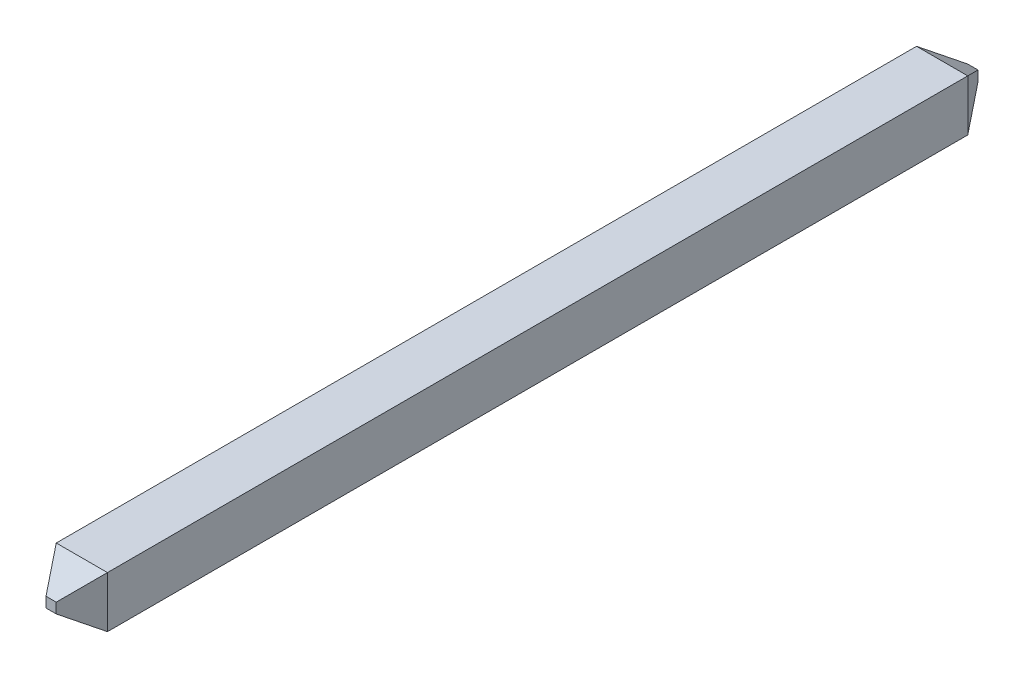
ISO-10303-21;
HEADER;
FILE_DESCRIPTION(('STEP AP214'),'2;1');
FILE_NAME('part.step','',(''),(''),'','','');
FILE_SCHEMA(('AUTOMOTIVE_DESIGN { 1 0 10303 214 1 1 1 1 }'));
ENDSEC;
DATA;
#1=APPLICATION_CONTEXT('core data for automotive mechanical design processes');
#2=APPLICATION_PROTOCOL_DEFINITION('international standard','automotive_design',2000,#1);
#3=PRODUCT_CONTEXT('',#1,'mechanical');
#4=PRODUCT('Part','Part','',(#3));
#5=PRODUCT_RELATED_PRODUCT_CATEGORY('part','',(#4));
#6=PRODUCT_DEFINITION_FORMATION('','',#4);
#7=PRODUCT_DEFINITION_CONTEXT('part definition',#1,'design');
#8=PRODUCT_DEFINITION('design','',#6,#7);
#9=PRODUCT_DEFINITION_SHAPE('','',#8);
#10=(LENGTH_UNIT() NAMED_UNIT(*) SI_UNIT(.MILLI.,.METRE.));
#11=(NAMED_UNIT(*) PLANE_ANGLE_UNIT() SI_UNIT($,.RADIAN.));
#12=(NAMED_UNIT(*) SI_UNIT($,.STERADIAN.) SOLID_ANGLE_UNIT());
#13=UNCERTAINTY_MEASURE_WITH_UNIT(LENGTH_MEASURE(1.E-05),#10,'distance_accuracy_value','');
#14=(GEOMETRIC_REPRESENTATION_CONTEXT(3) GLOBAL_UNCERTAINTY_ASSIGNED_CONTEXT((#13)) GLOBAL_UNIT_ASSIGNED_CONTEXT((#10,
#11,#12)) REPRESENTATION_CONTEXT('',''));
#15=CARTESIAN_POINT('',(0.,0.,0.));
#16=DIRECTION('',(0.,0.,1.));
#17=DIRECTION('',(1.,0.,0.));
#18=AXIS2_PLACEMENT_3D('',#15,#16,#17);
#19=CARTESIAN_POINT('',(0.0635,0.,-6.35));
#20=DIRECTION('',(-0.832050294337843,0.,0.55470019622523));
#21=DIRECTION('',(0.55470019622523,0.,0.832050294337843));
#22=AXIS2_PLACEMENT_3D('',#19,#20,#21);
#23=PLANE('',#22);
#24=DIRECTION('',(0.,1.,0.));
#25=VECTOR('',#24,1.);
#26=CARTESIAN_POINT('',(0.3175,7.9375,-5.969));
#27=LINE('',#26,#25);
#28=CARTESIAN_POINT('',(0.3175,7.3025,-5.969));
#29=VERTEX_POINT('',#28);
#30=CARTESIAN_POINT('',(0.3175,7.9375,-5.969));
#31=VERTEX_POINT('',#30);
#32=EDGE_CURVE('E103',#29,#31,#27,.T.);
#33=ORIENTED_EDGE('',*,*,#32,.F.);
#34=DIRECTION('',(-0.485071250072666,0.485071250072666,-0.727606875108999));
#35=VECTOR('',#34,1.);
#36=CARTESIAN_POINT('',(0.3175,7.3025,-5.969));
#37=LINE('',#36,#35);
#38=CARTESIAN_POINT('',(0.0635,7.5565,-6.35));
#39=VERTEX_POINT('',#38);
#40=EDGE_CURVE('E84',#29,#39,#37,.T.);
#41=ORIENTED_EDGE('',*,*,#40,.T.);
#42=DIRECTION('',(0.,1.,0.));
#43=VECTOR('',#42,1.);
#44=CARTESIAN_POINT('',(0.0635,0.,-6.35));
#45=LINE('',#44,#43);
#46=CARTESIAN_POINT('',(0.0635,7.6835,-6.35));
#47=VERTEX_POINT('',#46);
#48=EDGE_CURVE('E19',#47,#39,#45,.F.);
#49=ORIENTED_EDGE('',*,*,#48,.F.);
#50=DIRECTION('',(0.485071250072666,0.485071250072666,0.727606875108999));
#51=VECTOR('',#50,1.);
#52=CARTESIAN_POINT('',(0.0635,7.6835,-6.35));
#53=LINE('',#52,#51);
#54=EDGE_CURVE('E81',#47,#31,#53,.T.);
#55=ORIENTED_EDGE('',*,*,#54,.T.);
#56=EDGE_LOOP('',(#33,#41,#49,#55));
#57=FACE_BOUND('',#56,.T.);
#58=ADVANCED_FACE('F16',(#57),#23,.F.);
#59=CARTESIAN_POINT('',(0.3175,7.9375,4.699));
#60=DIRECTION('',(0.832050294337844,0.,0.554700196225229));
#61=DIRECTION('',(0.554700196225229,0.,-0.832050294337844));
#62=AXIS2_PLACEMENT_3D('',#59,#60,#61);
#63=PLANE('',#62);
#64=DIRECTION('',(-0.485071250072666,0.485071250072666,0.727606875108999));
#65=VECTOR('',#64,1.);
#66=CARTESIAN_POINT('',(0.3175,7.3025,4.699));
#67=LINE('',#66,#65);
#68=CARTESIAN_POINT('',(0.3175,7.3025,4.699));
#69=VERTEX_POINT('',#68);
#70=CARTESIAN_POINT('',(0.0635,7.5565,5.08));
#71=VERTEX_POINT('',#70);
#72=EDGE_CURVE('E108',#69,#71,#67,.T.);
#73=ORIENTED_EDGE('',*,*,#72,.F.);
#74=DIRECTION('',(0.,1.,0.));
#75=VECTOR('',#74,1.);
#76=CARTESIAN_POINT('',(0.3175,7.9375,4.699));
#77=LINE('',#76,#75);
#78=CARTESIAN_POINT('',(0.3175,7.9375,4.699));
#79=VERTEX_POINT('',#78);
#80=EDGE_CURVE('E105',#79,#69,#77,.F.);
#81=ORIENTED_EDGE('',*,*,#80,.F.);
#82=DIRECTION('',(0.485071250072666,0.485071250072666,-0.727606875108999));
#83=VECTOR('',#82,1.);
#84=CARTESIAN_POINT('',(0.0635,7.6835,5.08));
#85=LINE('',#84,#83);
#86=CARTESIAN_POINT('',(0.0635,7.6835,5.08));
#87=VERTEX_POINT('',#86);
#88=EDGE_CURVE('E115',#87,#79,#85,.T.);
#89=ORIENTED_EDGE('',*,*,#88,.F.);
#90=DIRECTION('',(0.,1.,0.));
#91=VECTOR('',#90,1.);
#92=CARTESIAN_POINT('',(0.0635,0.,5.08));
#93=LINE('',#92,#91);
#94=EDGE_CURVE('E111',#87,#71,#93,.F.);
#95=ORIENTED_EDGE('',*,*,#94,.T.);
#96=EDGE_LOOP('',(#73,#81,#89,#95));
#97=FACE_BOUND('',#96,.T.);
#98=ADVANCED_FACE('F181',(#97),#63,.T.);
#99=CARTESIAN_POINT('',(0.,0.,-6.35));
#100=DIRECTION('',(0.,0.,-1.));
#101=DIRECTION('',(-1.,0.,0.));
#102=AXIS2_PLACEMENT_3D('',#99,#100,#101);
#103=PLANE('',#102);
#104=DIRECTION('',(0.,1.,0.));
#105=VECTOR('',#104,1.);
#106=CARTESIAN_POINT('',(-0.0635,0.,-6.35));
#107=LINE('',#106,#105);
#108=CARTESIAN_POINT('',(-0.0635,7.5565,-6.35));
#109=VERTEX_POINT('',#108);
#110=CARTESIAN_POINT('',(-0.0634999999999999,7.6835,-6.35));
#111=VERTEX_POINT('',#110);
#112=EDGE_CURVE('E90',#109,#111,#107,.T.);
#113=ORIENTED_EDGE('',*,*,#112,.T.);
#114=DIRECTION('',(1.,0.,0.));
#115=VECTOR('',#114,1.);
#116=CARTESIAN_POINT('',(0.,7.6835,-6.35));
#117=LINE('',#116,#115);
#118=EDGE_CURVE('E86',#111,#47,#117,.T.);
#119=ORIENTED_EDGE('',*,*,#118,.T.);
#120=ORIENTED_EDGE('',*,*,#48,.T.);
#121=DIRECTION('',(1.,0.,0.));
#122=VECTOR('',#121,1.);
#123=CARTESIAN_POINT('',(0.,7.5565,-6.35));
#124=LINE('',#123,#122);
#125=EDGE_CURVE('E98',#39,#109,#124,.F.);
#126=ORIENTED_EDGE('',*,*,#125,.T.);
#127=EDGE_LOOP('',(#113,#119,#120,#126));
#128=FACE_BOUND('',#127,.T.);
#129=ADVANCED_FACE('F88',(#128),#103,.T.);
#130=CARTESIAN_POINT('',(0.,7.6835,-6.35));
#131=DIRECTION('',(0.,-0.832050294337843,0.55470019622523));
#132=DIRECTION('',(0.,-0.55470019622523,-0.832050294337843));
#133=AXIS2_PLACEMENT_3D('',#130,#131,#132);
#134=PLANE('',#133);
#135=DIRECTION('',(1.,0.,0.));
#136=VECTOR('',#135,1.);
#137=CARTESIAN_POINT('',(-0.3175,7.9375,-5.969));
#138=LINE('',#137,#136);
#139=CARTESIAN_POINT('',(-0.3175,7.9375,-5.969));
#140=VERTEX_POINT('',#139);
#141=EDGE_CURVE('E96',#31,#140,#138,.F.);
#142=ORIENTED_EDGE('',*,*,#141,.F.);
#143=ORIENTED_EDGE('',*,*,#54,.F.);
#144=ORIENTED_EDGE('',*,*,#118,.F.);
#145=DIRECTION('',(-0.485071250072667,0.485071250072666,0.727606875108998));
#146=VECTOR('',#145,1.);
#147=CARTESIAN_POINT('',(-0.0635,7.6835,-6.35));
#148=LINE('',#147,#146);
#149=EDGE_CURVE('E131',#111,#140,#148,.T.);
#150=ORIENTED_EDGE('',*,*,#149,.T.);
#151=EDGE_LOOP('',(#142,#143,#144,#150));
#152=FACE_BOUND('',#151,.T.);
#153=ADVANCED_FACE('F94',(#152),#134,.F.);
#154=CARTESIAN_POINT('',(0.,7.5565,-6.35));
#155=DIRECTION('',(0.,0.832050294337843,0.55470019622523));
#156=DIRECTION('',(0.,-0.55470019622523,0.832050294337843));
#157=AXIS2_PLACEMENT_3D('',#154,#155,#156);
#158=PLANE('',#157);
#159=DIRECTION('',(1.,0.,0.));
#160=VECTOR('',#159,1.);
#161=CARTESIAN_POINT('',(0.3175,7.3025,-5.969));
#162=LINE('',#161,#160);
#163=CARTESIAN_POINT('',(-0.3175,7.3025,-5.969));
#164=VERTEX_POINT('',#163);
#165=EDGE_CURVE('E133',#164,#29,#162,.T.);
#166=ORIENTED_EDGE('',*,*,#165,.F.);
#167=DIRECTION('',(0.485071250072667,0.485071250072666,-0.727606875108998));
#168=VECTOR('',#167,1.);
#169=CARTESIAN_POINT('',(-0.3175,7.3025,-5.969));
#170=LINE('',#169,#168);
#171=EDGE_CURVE('E127',#164,#109,#170,.T.);
#172=ORIENTED_EDGE('',*,*,#171,.T.);
#173=ORIENTED_EDGE('',*,*,#125,.F.);
#174=ORIENTED_EDGE('',*,*,#40,.F.);
#175=EDGE_LOOP('',(#166,#172,#173,#174));
#176=FACE_BOUND('',#175,.T.);
#177=ADVANCED_FACE('F177',(#176),#158,.F.);
#178=CARTESIAN_POINT('',(0.3175,7.9375,5.08));
#179=DIRECTION('',(1.,0.,0.));
#180=DIRECTION('',(0.,0.,-1.));
#181=AXIS2_PLACEMENT_3D('',#178,#179,#180);
#182=PLANE('',#181);
#183=DIRECTION('',(0.,0.,1.));
#184=VECTOR('',#183,1.);
#185=CARTESIAN_POINT('',(0.3175,7.9375,5.08));
#186=LINE('',#185,#184);
#187=EDGE_CURVE('E121',#79,#31,#186,.F.);
#188=ORIENTED_EDGE('',*,*,#187,.F.);
#189=ORIENTED_EDGE('',*,*,#80,.T.);
#190=DIRECTION('',(0.,0.,-1.));
#191=VECTOR('',#190,1.);
#192=CARTESIAN_POINT('',(0.3175,7.3025,5.08));
#193=LINE('',#192,#191);
#194=EDGE_CURVE('E136',#29,#69,#193,.F.);
#195=ORIENTED_EDGE('',*,*,#194,.F.);
#196=ORIENTED_EDGE('',*,*,#32,.T.);
#197=EDGE_LOOP('',(#188,#189,#195,#196));
#198=FACE_BOUND('',#197,.T.);
#199=ADVANCED_FACE('F179',(#198),#182,.T.);
#200=CARTESIAN_POINT('',(0.3175,7.3025,4.699));
#201=DIRECTION('',(0.,-0.832050294337844,0.554700196225229));
#202=DIRECTION('',(0.,-0.554700196225229,-0.832050294337844));
#203=AXIS2_PLACEMENT_3D('',#200,#201,#202);
#204=PLANE('',#203);
#205=DIRECTION('',(0.485071250072666,0.485071250072666,0.727606875108999));
#206=VECTOR('',#205,1.);
#207=CARTESIAN_POINT('',(-0.3175,7.3025,4.699));
#208=LINE('',#207,#206);
#209=CARTESIAN_POINT('',(-0.3175,7.3025,4.699));
#210=VERTEX_POINT('',#209);
#211=CARTESIAN_POINT('',(-0.0635,7.5565,5.08));
#212=VERTEX_POINT('',#211);
#213=EDGE_CURVE('E34',#210,#212,#208,.T.);
#214=ORIENTED_EDGE('',*,*,#213,.F.);
#215=DIRECTION('',(1.,0.,0.));
#216=VECTOR('',#215,1.);
#217=CARTESIAN_POINT('',(0.3175,7.3025,4.699));
#218=LINE('',#217,#216);
#219=EDGE_CURVE('E139',#69,#210,#218,.F.);
#220=ORIENTED_EDGE('',*,*,#219,.F.);
#221=ORIENTED_EDGE('',*,*,#72,.T.);
#222=DIRECTION('',(-1.,0.,0.));
#223=VECTOR('',#222,1.);
#224=CARTESIAN_POINT('',(0.,7.5565,5.08));
#225=LINE('',#224,#223);
#226=EDGE_CURVE('E113',#71,#212,#225,.T.);
#227=ORIENTED_EDGE('',*,*,#226,.T.);
#228=EDGE_LOOP('',(#214,#220,#221,#227));
#229=FACE_BOUND('',#228,.T.);
#230=ADVANCED_FACE('F184',(#229),#204,.T.);
#231=CARTESIAN_POINT('',(0.,0.,5.08));
#232=DIRECTION('',(0.,0.,-1.));
#233=DIRECTION('',(-1.,0.,0.));
#234=AXIS2_PLACEMENT_3D('',#231,#232,#233);
#235=PLANE('',#234);
#236=DIRECTION('',(0.,1.,0.));
#237=VECTOR('',#236,1.);
#238=CARTESIAN_POINT('',(-0.0635,7.3025,5.08));
#239=LINE('',#238,#237);
#240=CARTESIAN_POINT('',(-0.0635,7.6835,5.08));
#241=VERTEX_POINT('',#240);
#242=EDGE_CURVE('E142',#212,#241,#239,.T.);
#243=ORIENTED_EDGE('',*,*,#242,.F.);
#244=ORIENTED_EDGE('',*,*,#226,.F.);
#245=ORIENTED_EDGE('',*,*,#94,.F.);
#246=DIRECTION('',(1.,0.,0.));
#247=VECTOR('',#246,1.);
#248=CARTESIAN_POINT('',(-0.3175,7.6835,5.08));
#249=LINE('',#248,#247);
#250=EDGE_CURVE('E118',#241,#87,#249,.T.);
#251=ORIENTED_EDGE('',*,*,#250,.F.);
#252=EDGE_LOOP('',(#243,#244,#245,#251));
#253=FACE_BOUND('',#252,.T.);
#254=ADVANCED_FACE('F186',(#253),#235,.F.);
#255=CARTESIAN_POINT('',(-0.3175,7.9375,4.699));
#256=DIRECTION('',(0.,0.832050294337844,0.554700196225229));
#257=DIRECTION('',(0.,-0.554700196225229,0.832050294337844));
#258=AXIS2_PLACEMENT_3D('',#255,#256,#257);
#259=PLANE('',#258);
#260=DIRECTION('',(-0.485071250072666,0.485071250072666,-0.727606875108999));
#261=VECTOR('',#260,1.);
#262=CARTESIAN_POINT('',(-0.0635,7.6835,5.08));
#263=LINE('',#262,#261);
#264=CARTESIAN_POINT('',(-0.3175,7.9375,4.699));
#265=VERTEX_POINT('',#264);
#266=EDGE_CURVE('E145',#241,#265,#263,.T.);
#267=ORIENTED_EDGE('',*,*,#266,.F.);
#268=ORIENTED_EDGE('',*,*,#250,.T.);
#269=ORIENTED_EDGE('',*,*,#88,.T.);
#270=DIRECTION('',(1.,0.,0.));
#271=VECTOR('',#270,1.);
#272=CARTESIAN_POINT('',(-0.3175,7.9375,4.699));
#273=LINE('',#272,#271);
#274=EDGE_CURVE('E124',#265,#79,#273,.T.);
#275=ORIENTED_EDGE('',*,*,#274,.F.);
#276=EDGE_LOOP('',(#267,#268,#269,#275));
#277=FACE_BOUND('',#276,.T.);
#278=ADVANCED_FACE('F168',(#277),#259,.T.);
#279=CARTESIAN_POINT('',(-0.3175,7.9375,5.08));
#280=DIRECTION('',(0.,1.,0.));
#281=DIRECTION('',(0.,0.,1.));
#282=AXIS2_PLACEMENT_3D('',#279,#280,#281);
#283=PLANE('',#282);
#284=DIRECTION('',(0.,0.,1.));
#285=VECTOR('',#284,1.);
#286=CARTESIAN_POINT('',(-0.3175,7.9375,5.08));
#287=LINE('',#286,#285);
#288=EDGE_CURVE('E148',#265,#140,#287,.F.);
#289=ORIENTED_EDGE('',*,*,#288,.F.);
#290=ORIENTED_EDGE('',*,*,#274,.T.);
#291=ORIENTED_EDGE('',*,*,#187,.T.);
#292=ORIENTED_EDGE('',*,*,#141,.T.);
#293=EDGE_LOOP('',(#289,#290,#291,#292));
#294=FACE_BOUND('',#293,.T.);
#295=ADVANCED_FACE('F171',(#294),#283,.T.);
#296=CARTESIAN_POINT('',(-0.0635,0.,-6.35));
#297=DIRECTION('',(0.832050294337843,0.,0.55470019622523));
#298=DIRECTION('',(0.55470019622523,0.,-0.832050294337843));
#299=AXIS2_PLACEMENT_3D('',#296,#297,#298);
#300=PLANE('',#299);
#301=ORIENTED_EDGE('',*,*,#112,.F.);
#302=ORIENTED_EDGE('',*,*,#171,.F.);
#303=DIRECTION('',(0.,1.,0.));
#304=VECTOR('',#303,1.);
#305=CARTESIAN_POINT('',(-0.3175,7.3025,-5.969));
#306=LINE('',#305,#304);
#307=EDGE_CURVE('E151',#140,#164,#306,.F.);
#308=ORIENTED_EDGE('',*,*,#307,.F.);
#309=ORIENTED_EDGE('',*,*,#149,.F.);
#310=EDGE_LOOP('',(#301,#302,#308,#309));
#311=FACE_BOUND('',#310,.T.);
#312=ADVANCED_FACE('F175',(#311),#300,.F.);
#313=CARTESIAN_POINT('',(0.3175,7.3025,5.08));
#314=DIRECTION('',(0.,-1.,0.));
#315=DIRECTION('',(0.,0.,-1.));
#316=AXIS2_PLACEMENT_3D('',#313,#314,#315);
#317=PLANE('',#316);
#318=ORIENTED_EDGE('',*,*,#194,.T.);
#319=ORIENTED_EDGE('',*,*,#219,.T.);
#320=DIRECTION('',(0.,0.,1.));
#321=VECTOR('',#320,1.);
#322=CARTESIAN_POINT('',(-0.3175,7.3025,5.08));
#323=LINE('',#322,#321);
#324=EDGE_CURVE('E25',#164,#210,#323,.T.);
#325=ORIENTED_EDGE('',*,*,#324,.F.);
#326=ORIENTED_EDGE('',*,*,#165,.T.);
#327=EDGE_LOOP('',(#318,#319,#325,#326));
#328=FACE_BOUND('',#327,.T.);
#329=ADVANCED_FACE('F161',(#328),#317,.T.);
#330=CARTESIAN_POINT('',(-0.3175,7.3025,4.699));
#331=DIRECTION('',(-0.832050294337844,0.,0.554700196225229));
#332=DIRECTION('',(0.554700196225229,0.,0.832050294337844));
#333=AXIS2_PLACEMENT_3D('',#330,#331,#332);
#334=PLANE('',#333);
#335=ORIENTED_EDGE('',*,*,#266,.T.);
#336=DIRECTION('',(0.,1.,0.));
#337=VECTOR('',#336,1.);
#338=CARTESIAN_POINT('',(-0.3175,7.3025,4.699));
#339=LINE('',#338,#337);
#340=EDGE_CURVE('E11',#210,#265,#339,.T.);
#341=ORIENTED_EDGE('',*,*,#340,.F.);
#342=ORIENTED_EDGE('',*,*,#213,.T.);
#343=ORIENTED_EDGE('',*,*,#242,.T.);
#344=EDGE_LOOP('',(#335,#341,#342,#343));
#345=FACE_BOUND('',#344,.T.);
#346=ADVANCED_FACE('F164',(#345),#334,.T.);
#347=CARTESIAN_POINT('',(-0.3175,7.3025,5.08));
#348=DIRECTION('',(-1.,0.,0.));
#349=DIRECTION('',(0.,0.,1.));
#350=AXIS2_PLACEMENT_3D('',#347,#348,#349);
#351=PLANE('',#350);
#352=ORIENTED_EDGE('',*,*,#324,.T.);
#353=ORIENTED_EDGE('',*,*,#340,.T.);
#354=ORIENTED_EDGE('',*,*,#288,.T.);
#355=ORIENTED_EDGE('',*,*,#307,.T.);
#356=EDGE_LOOP('',(#352,#353,#354,#355));
#357=FACE_BOUND('',#356,.T.);
#358=ADVANCED_FACE('F157',(#357),#351,.T.);
#359=CLOSED_SHELL('',(#58,#98,#129,#153,#177,#199,#230,#254,#278,#295,#312,#329,#346,#358));
#360=MANIFOLD_SOLID_BREP('B1',#359);
#361=ADVANCED_BREP_SHAPE_REPRESENTATION('',(#18,#360),#14);
#362=SHAPE_DEFINITION_REPRESENTATION(#9,#361);
ENDSEC;
END-ISO-10303-21;
